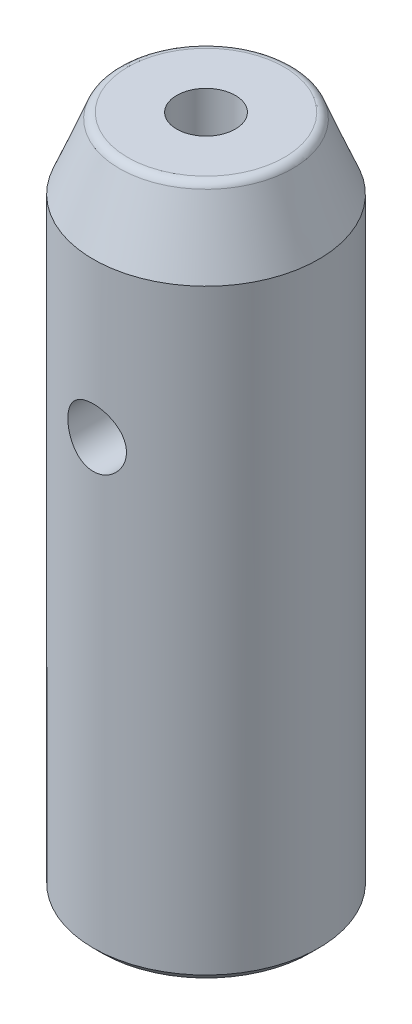
ISO-10303-21;
HEADER;
FILE_DESCRIPTION(('STEP AP214'),'2;1');
FILE_NAME('part.step','',(''),(''),'','','');
FILE_SCHEMA(('AUTOMOTIVE_DESIGN { 1 0 10303 214 1 1 1 1 }'));
ENDSEC;
DATA;
#1=APPLICATION_CONTEXT('core data for automotive mechanical design processes');
#2=APPLICATION_PROTOCOL_DEFINITION('international standard','automotive_design',2000,#1);
#3=PRODUCT_CONTEXT('',#1,'mechanical');
#4=PRODUCT('Part','Part','',(#3));
#5=PRODUCT_RELATED_PRODUCT_CATEGORY('part','',(#4));
#6=PRODUCT_DEFINITION_FORMATION('','',#4);
#7=PRODUCT_DEFINITION_CONTEXT('part definition',#1,'design');
#8=PRODUCT_DEFINITION('design','',#6,#7);
#9=PRODUCT_DEFINITION_SHAPE('','',#8);
#10=(LENGTH_UNIT() NAMED_UNIT(*) SI_UNIT(.MILLI.,.METRE.));
#11=(NAMED_UNIT(*) PLANE_ANGLE_UNIT() SI_UNIT($,.RADIAN.));
#12=(NAMED_UNIT(*) SI_UNIT($,.STERADIAN.) SOLID_ANGLE_UNIT());
#13=UNCERTAINTY_MEASURE_WITH_UNIT(LENGTH_MEASURE(1.E-05),#10,'distance_accuracy_value','');
#14=(GEOMETRIC_REPRESENTATION_CONTEXT(3) GLOBAL_UNCERTAINTY_ASSIGNED_CONTEXT((#13)) GLOBAL_UNIT_ASSIGNED_CONTEXT((#10,
#11,#12)) REPRESENTATION_CONTEXT('',''));
#15=CARTESIAN_POINT('',(0.,0.,0.));
#16=DIRECTION('',(0.,0.,1.));
#17=DIRECTION('',(1.,0.,0.));
#18=AXIS2_PLACEMENT_3D('',#15,#16,#17);
#19=CARTESIAN_POINT('',(0.,11.0000000000241,0.));
#20=DIRECTION('',(0.,-1.,0.));
#21=DIRECTION('',(0.,0.,-1.));
#22=AXIS2_PLACEMENT_3D('',#19,#20,#21);
#23=CONICAL_SURFACE('',#22,2.49999999999773,1.02974425868524);
#24=CARTESIAN_POINT('',(0.,12.5021515474941,-1.13686837721616E-10));
#25=VERTEX_POINT('',#24);
#26=VERTEX_LOOP('',#25);
#27=FACE_BOUND('',#26,.T.);
#28=CARTESIAN_POINT('',(0.,11.,0.));
#29=DIRECTION('',(0.,-1.,0.));
#30=DIRECTION('',(0.,0.,-1.));
#31=AXIS2_PLACEMENT_3D('',#28,#29,#30);
#32=CIRCLE('',#31,2.5);
#33=CARTESIAN_POINT('',(0.,11.,-2.5));
#34=VERTEX_POINT('',#33);
#35=EDGE_CURVE('E33',#34,#34,#32,.T.);
#36=ORIENTED_EDGE('',*,*,#35,.T.);
#37=EDGE_LOOP('',(#36));
#38=FACE_BOUND('',#37,.T.);
#39=ADVANCED_FACE('F17',(#27,#38),#23,.F.);
#40=CARTESIAN_POINT('',(0.,38.1,0.));
#41=DIRECTION('',(0.,1.,0.));
#42=DIRECTION('',(0.,0.,1.));
#43=AXIS2_PLACEMENT_3D('',#40,#41,#42);
#44=CYLINDRICAL_SURFACE('',#43,1.65);
#45=CARTESIAN_POINT('',(0.,38.1,0.));
#46=DIRECTION('',(0.,1.,0.));
#47=DIRECTION('',(0.,0.,1.));
#48=AXIS2_PLACEMENT_3D('',#45,#46,#47);
#49=CIRCLE('',#48,1.65);
#50=CARTESIAN_POINT('',(0.,38.1,1.65));
#51=VERTEX_POINT('',#50);
#52=EDGE_CURVE('E20',#51,#51,#49,.F.);
#53=ORIENTED_EDGE('',*,*,#52,.F.);
#54=EDGE_LOOP('',(#53));
#55=FACE_BOUND('',#54,.T.);
#56=CARTESIAN_POINT('',(0.,28.00000000002,0.));
#57=DIRECTION('',(0.,1.,0.));
#58=DIRECTION('',(0.,0.,1.));
#59=AXIS2_PLACEMENT_3D('',#56,#57,#58);
#60=CIRCLE('',#59,1.64999999992688);
#61=CARTESIAN_POINT('',(0.,28.00000000002,1.64999999992688));
#62=VERTEX_POINT('',#61);
#63=EDGE_CURVE('E37',#62,#62,#60,.F.);
#64=ORIENTED_EDGE('',*,*,#63,.T.);
#65=EDGE_LOOP('',(#64));
#66=FACE_BOUND('',#65,.T.);
#67=ADVANCED_FACE('F30',(#55,#66),#44,.F.);
#68=CARTESIAN_POINT('',(0.,0.,0.));
#69=DIRECTION('',(0.,-1.,0.));
#70=DIRECTION('',(0.,0.,-1.));
#71=AXIS2_PLACEMENT_3D('',#68,#69,#70);
#72=CYLINDRICAL_SURFACE('',#71,2.5);
#73=CARTESIAN_POINT('',(0.,0.,0.));
#74=DIRECTION('',(0.,-1.,0.));
#75=DIRECTION('',(0.,0.,-1.));
#76=AXIS2_PLACEMENT_3D('',#73,#74,#75);
#77=CIRCLE('',#76,2.5);
#78=CARTESIAN_POINT('',(0.,0.,-2.5));
#79=VERTEX_POINT('',#78);
#80=EDGE_CURVE('E95',#79,#79,#77,.T.);
#81=ORIENTED_EDGE('',*,*,#80,.T.);
#82=EDGE_LOOP('',(#81));
#83=FACE_BOUND('',#82,.T.);
#84=ORIENTED_EDGE('',*,*,#35,.F.);
#85=EDGE_LOOP('',(#84));
#86=FACE_BOUND('',#85,.T.);
#87=ADVANCED_FACE('F107',(#83,#86),#72,.F.);
#88=CARTESIAN_POINT('',(0.,38.1,0.));
#89=DIRECTION('',(0.,1.,0.));
#90=DIRECTION('',(0.,0.,1.));
#91=AXIS2_PLACEMENT_3D('',#88,#89,#90);
#92=PLANE('',#91);
#93=ORIENTED_EDGE('',*,*,#52,.T.);
#94=EDGE_LOOP('',(#93));
#95=FACE_BOUND('',#94,.T.);
#96=CARTESIAN_POINT('',(0.,38.1,0.));
#97=DIRECTION('',(0.,-1.,0.));
#98=DIRECTION('',(0.,0.,1.));
#99=AXIS2_PLACEMENT_3D('',#96,#97,#98);
#100=CIRCLE('',#99,4.41148351928659);
#101=CARTESIAN_POINT('',(0.,38.1,4.41148351928659));
#102=VERTEX_POINT('',#101);
#103=EDGE_CURVE('E90',#102,#102,#100,.T.);
#104=ORIENTED_EDGE('',*,*,#103,.F.);
#105=EDGE_LOOP('',(#104));
#106=FACE_BOUND('',#105,.T.);
#107=ADVANCED_FACE('F102',(#95,#106),#92,.T.);
#108=CARTESIAN_POINT('',(0.,28.00000000002,0.));
#109=DIRECTION('',(0.,1.,0.));
#110=DIRECTION('',(0.,0.,1.));
#111=AXIS2_PLACEMENT_3D('',#108,#109,#110);
#112=CONICAL_SURFACE('',#111,1.64999999992688,1.02974425867647);
#113=ORIENTED_EDGE('',*,*,#63,.F.);
#114=EDGE_LOOP('',(#113));
#115=FACE_BOUND('',#114,.T.);
#116=CARTESIAN_POINT('',(-0.0573261511325367,27.0490038545713,-0.0352116028123036));
#117=CARTESIAN_POINT('',(-0.0554022883564741,27.0490707375837,-0.038556116347012));
#118=CARTESIAN_POINT('',(-0.0531981532068544,27.0491440256652,-0.0417422648497794));
#119=CARTESIAN_POINT('',(-0.0482828474681584,27.049295242614,-0.0477003559953677));
#120=CARTESIAN_POINT('',(-0.045571176627391,27.0493731760078,-0.0504718850777985));
#121=CARTESIAN_POINT('',(-0.0397197199366535,27.0495244373037,-0.055503559686898));
#122=CARTESIAN_POINT('',(-0.0365810372526559,27.0495977763842,-0.0577649842878492));
#123=CARTESIAN_POINT('',(-0.0299586933464662,27.0497313166699,-0.0617075438590925));
#124=CARTESIAN_POINT('',(-0.0264751554199033,27.0497915225461,-0.0633888852683623));
#125=CARTESIAN_POINT('',(-0.0193829444498653,27.0498898330941,-0.0660675180039986));
#126=CARTESIAN_POINT('',(-0.0157819806981253,27.0499285905414,-0.0670852043273657));
#127=CARTESIAN_POINT('',(-0.00845849365793215,27.049982377865,-0.068485518452514));
#128=CARTESIAN_POINT('',(-0.00473598766995236,27.0499974111035,-0.06886823623814));
#129=CARTESIAN_POINT('',(0.0026303440330709,27.0500019182519,-0.0689835781464191));
#130=CARTESIAN_POINT('',(0.00627394045402025,27.0499919902664,-0.0687314146766817));
#131=CARTESIAN_POINT('',(0.0134664056922076,27.0499489665894,-0.0676177318403033));
#132=CARTESIAN_POINT('',(0.017015278206424,27.0499158718034,-0.066756236291472));
#133=CARTESIAN_POINT('',(0.023911489152531,27.0498303305146,-0.0644556751678007));
#134=CARTESIAN_POINT('',(0.0272592414135678,27.0497779254504,-0.0630178457912274));
#135=CARTESIAN_POINT('',(0.0336722325297795,27.0496595047019,-0.0596113616398685));
#136=CARTESIAN_POINT('',(0.0367374494462456,27.049593487962,-0.0576426656901093));
#137=CARTESIAN_POINT('',(0.042565565757976,27.0494535010409,-0.0531908473222734));
#138=CARTESIAN_POINT('',(0.0453212203986708,27.049379398544,-0.0506982522580331));
#139=CARTESIAN_POINT('',(0.0503905840951958,27.0492323170862,-0.0452983868932353));
#140=CARTESIAN_POINT('',(0.0527042278041586,27.0491593382928,-0.0423910553888745));
#141=CARTESIAN_POINT('',(0.0569012103048406,27.0490199553581,-0.0361466324304289));
#142=CARTESIAN_POINT('',(0.0587687275349002,27.0489538301738,-0.0327989006571047));
#143=CARTESIAN_POINT('',(0.0619336223044264,27.0488379981192,-0.0258437793221414));
#144=CARTESIAN_POINT('',(0.063230912492797,27.0487882937646,-0.0222363500767833));
#145=CARTESIAN_POINT('',(0.0652553482045757,27.0487094366802,-0.0147526756738244));
#146=CARTESIAN_POINT('',(0.065964975982419,27.0486809178465,-0.0108716787283606));
#147=CARTESIAN_POINT('',(0.0667340439080673,27.0486499679053,-0.00304555578656798));
#148=CARTESIAN_POINT('',(0.0667934141245729,27.0486475396036,0.000899577061502196));
#149=CARTESIAN_POINT('',(0.0662563776812016,27.0486692108696,0.00880601717686691));
#150=CARTESIAN_POINT('',(0.0656498993415126,27.0486937178691,0.0127666445127038));
#151=CARTESIAN_POINT('',(0.0637790846822597,27.0487671443867,0.0205294397628534));
#152=CARTESIAN_POINT('',(0.0625147342493535,27.0488160644286,0.0243316042757701));
#153=CARTESIAN_POINT('',(0.0593636482786148,27.0489325099751,0.0316538052088535));
#154=CARTESIAN_POINT('',(0.0574789897989906,27.0489999732662,0.0351747350834362));
#155=CARTESIAN_POINT('',(0.0531330610918169,27.0491457139671,0.0418408559754558));
#156=CARTESIAN_POINT('',(0.0506718458134014,27.0492239903461,0.0449860827564238));
#157=CARTESIAN_POINT('',(0.0452966677950328,27.0493802673108,0.0507363852188888));
#158=CARTESIAN_POINT('',(0.0423935966964446,27.0494582375328,0.0533516346682113));
#159=CARTESIAN_POINT('',(0.0361768853794523,27.0496062782607,0.0580380482193767));
#160=CARTESIAN_POINT('',(0.0328633252350365,27.0496763503024,0.0601093181899663));
#161=CARTESIAN_POINT('',(0.0260345207061876,27.0497980104142,0.0635776359221747));
#162=CARTESIAN_POINT('',(0.0225292487693694,27.0498501224462,0.0649943014809938));
#163=CARTESIAN_POINT('',(0.0153262893743198,27.0499327428713,0.0671998783707369));
#164=CARTESIAN_POINT('',(0.0116286384458393,27.0499632553499,0.0679889084196441));
#165=CARTESIAN_POINT('',(0.00425845377844512,27.0499985037144,0.0688976252329457));
#166=CARTESIAN_POINT('',(0.000588172157832474,27.0500039448395,0.0690356276513406));
#167=CARTESIAN_POINT('',(-0.00672239125698741,27.049990353846,0.0686873248544185));
#168=CARTESIAN_POINT('',(-0.0103626754763837,27.0499713237257,0.0682010706165511));
#169=CARTESIAN_POINT('',(-0.0174742174567961,27.0499112663567,0.066628908678843));
#170=CARTESIAN_POINT('',(-0.0209467584654534,27.0498704511517,0.0655487784335639));
#171=CARTESIAN_POINT('',(-0.0276647235734719,27.0497714875772,0.0628288651340028));
#172=CARTESIAN_POINT('',(-0.0309101368101057,27.0497133383792,0.0611890553342166));
#173=CARTESIAN_POINT('',(-0.0371317678743533,27.0495851175659,0.0573756078298115));
#174=CARTESIAN_POINT('',(-0.040103658519587,27.0495148926611,0.0551949234456392));
#175=CARTESIAN_POINT('',(-0.0456522709851782,27.0493706646999,0.0503787183853062));
#176=CARTESIAN_POINT('',(-0.0482289392833058,27.0492966611337,0.0477431362080121));
#177=CARTESIAN_POINT('',(-0.0529952978236249,27.0491504976728,0.0420098254992985));
#178=CARTESIAN_POINT('',(-0.0551713882269241,27.0490784558962,0.0389007905155657));
#179=CARTESIAN_POINT('',(-0.0589892048356415,27.0489463103858,0.032370363933503));
#180=CARTESIAN_POINT('',(-0.0606308682977522,27.0488862080539,0.0289489357196169));
#181=CARTESIAN_POINT('',(-0.0633853476853365,27.0487826626372,0.0217771220417472));
#182=CARTESIAN_POINT('',(-0.0644802191377082,27.0487397928603,0.0180198319858661));
#183=CARTESIAN_POINT('',(-0.0660384140146463,27.0486781191435,0.0103751798054958));
#184=CARTESIAN_POINT('',(-0.0665015009678746,27.0486593242146,0.0064877695356133));
#185=CARTESIAN_POINT('',(-0.0667883152752586,27.0486477323133,-0.00139174106050955));
#186=CARTESIAN_POINT('',(-0.0665985085714728,27.0486554856541,-0.00538433404697239));
#187=CARTESIAN_POINT('',(-0.0655536171695187,27.0486973640991,-0.0132782215478515));
#188=CARTESIAN_POINT('',(-0.0646992929569139,27.0487314590573,-0.0171796151786816));
#189=CARTESIAN_POINT('',(-0.0627577278483956,27.0488062439402,-0.0234565006415779));
#190=CARTESIAN_POINT('',(-0.0618549121945808,27.0488405131464,-0.0258906639057135));
#191=CARTESIAN_POINT('',(-0.0597856555422953,27.0489168418295,-0.0306442674073107));
#192=CARTESIAN_POINT('',(-0.0586192082689324,27.0489589014917,-0.0329637049124973));
#193=CARTESIAN_POINT('',(-0.0573261511325367,27.0490038545713,-0.0352116028123036));
#194=B_SPLINE_CURVE_WITH_KNOTS('',3,(#116,#117,#118,#119,#120,#121,#122,#123,#124,#125,#126,
#127,#128,#129,#130,#131,#132,#133,#134,#135,#136,#137,#138,#139,#140,#141,#142,#143,#144,#145,
#146,#147,#148,#149,#150,#151,#152,#153,#154,#155,#156,#157,#158,#159,#160,#161,#162,#163,#164,
#165,#166,#167,#168,#169,#170,#171,#172,#173,#174,#175,#176,#177,#178,#179,#180,#181,#182,#183,
#184,#185,#186,#187,#188,#189,#190,#191,#192,#193),.UNSPECIFIED.,.T.,.F.,(4,2,2,2,2,2,2,2,2,2,2,
2,2,2,2,2,2,2,2,2,2,2,2,2,2,2,2,2,2,2,2,2,2,2,2,2,2,2,4),(0.,0.0115675319698419,
0.0231465260800058,0.0346961551600966,0.0462416697286678,0.057413174282501,0.0685830955439932,
0.079487933392747,0.090392345012503,0.101273491483959,0.112155482159726,0.12325440338767,
0.134354964211771,0.145804638468706,0.157256066050655,0.169037677487108,0.180820555952747,
0.192784149582647,0.204747999878329,0.216672190819152,0.22859524577895,0.240261530903162,
0.251925543861198,0.263212779952904,0.274497880542819,0.285463519471979,0.296428262992586,
0.307288177678272,0.318148611401269,0.329158744395207,0.340170367101411,0.351505639797535,
0.362842242808747,0.37452978719499,0.386221704926459,0.398157436347895,0.410079528368755,
0.417854055693193,0.425628768084428),.UNSPECIFIED.);
#195=CARTESIAN_POINT('',(-0.0573261511325367,27.0490038545713,-0.0352116028123036));
#196=VERTEX_POINT('',#195);
#197=EDGE_CURVE('E86',#196,#196,#194,.T.);
#198=ORIENTED_EDGE('',*,*,#197,.T.);
#199=EDGE_LOOP('',(#198));
#200=FACE_BOUND('',#199,.T.);
#201=ADVANCED_FACE('F96',(#115,#200),#112,.F.);
#202=CARTESIAN_POINT('',(0.,0.,0.));
#203=DIRECTION('',(0.,1.,0.));
#204=DIRECTION('',(0.,0.,1.));
#205=AXIS2_PLACEMENT_3D('',#202,#203,#204);
#206=PLANE('',#205);
#207=ORIENTED_EDGE('',*,*,#80,.F.);
#208=EDGE_LOOP('',(#207));
#209=FACE_BOUND('',#208,.T.);
#210=CARTESIAN_POINT('',(0.,-1.13686837721616E-10,0.));
#211=DIRECTION('',(0.,1.,0.));
#212=DIRECTION('',(0.,0.,1.));
#213=AXIS2_PLACEMENT_3D('',#210,#211,#212);
#214=CIRCLE('',#213,5.84999999995262);
#215=CARTESIAN_POINT('',(0.,-1.13686837721616E-10,5.84999999995262));
#216=VERTEX_POINT('',#215);
#217=EDGE_CURVE('E83',#216,#216,#214,.T.);
#218=ORIENTED_EDGE('',*,*,#217,.F.);
#219=EDGE_LOOP('',(#218));
#220=FACE_BOUND('',#219,.T.);
#221=ADVANCED_FACE('F101',(#209,#220),#206,.F.);
#222=CARTESIAN_POINT('',(0.,37.6,0.));
#223=DIRECTION('',(0.,1.,0.));
#224=DIRECTION('',(0.,0.,1.));
#225=AXIS2_PLACEMENT_3D('',#222,#223,#224);
#226=TOROIDAL_SURFACE('',#225,4.41148351928659,0.5);
#227=ORIENTED_EDGE('',*,*,#103,.T.);
#228=EDGE_LOOP('',(#227));
#229=FACE_BOUND('',#228,.T.);
#230=CARTESIAN_POINT('',(0.,37.7856953381297,0.));
#231=DIRECTION('',(0.,-1.,0.));
#232=DIRECTION('',(0.,0.,-1.));
#233=AXIS2_PLACEMENT_3D('',#230,#231,#232);
#234=CIRCLE('',#233,4.87572186472107);
#235=CARTESIAN_POINT('',(0.,37.7856953381297,-4.87572186472107));
#236=VERTEX_POINT('',#235);
#237=EDGE_CURVE('E85',#236,#236,#234,.T.);
#238=ORIENTED_EDGE('',*,*,#237,.F.);
#239=EDGE_LOOP('',(#238));
#240=FACE_BOUND('',#239,.T.);
#241=ADVANCED_FACE('F76',(#229,#240),#226,.T.);
#242=CARTESIAN_POINT('',(0.,25.4,-6.35));
#243=DIRECTION('',(0.,0.,1.));
#244=DIRECTION('',(1.,0.,0.));
#245=AXIS2_PLACEMENT_3D('',#242,#243,#244);
#246=CYLINDRICAL_SURFACE('',#245,1.65);
#247=CARTESIAN_POINT('',(0.,27.05,-6.35));
#248=CARTESIAN_POINT('',(-0.091044846800309,27.0499976682171,-6.34999855029433));
#249=CARTESIAN_POINT('',(-0.182115106595808,27.0424390947502,-6.34802256023355));
#250=CARTESIAN_POINT('',(-0.361637722456892,27.012454585361,-6.34033166229604));
#251=CARTESIAN_POINT('',(-0.450088700922075,26.990020966117,-6.33461482219966));
#252=CARTESIAN_POINT('',(-0.621755015806406,26.9310607468939,-6.32007407349406));
#253=CARTESIAN_POINT('',(-0.704976759571182,26.8945518010085,-6.3112540582741));
#254=CARTESIAN_POINT('',(-0.864115385464066,26.8085413495376,-6.29144207556038));
#255=CARTESIAN_POINT('',(-0.940031879382966,26.7590391539967,-6.28044999273518));
#256=CARTESIAN_POINT('',(-1.08408361281692,26.6472915375345,-6.25721162305243));
#257=CARTESIAN_POINT('',(-1.1520343076235,26.5848124948755,-6.2449447581951));
#258=CARTESIAN_POINT('',(-1.27662045234933,26.4493844653781,-6.22067339979481));
#259=CARTESIAN_POINT('',(-1.33325452218134,26.3764342034133,-6.20866893841133));
#260=CARTESIAN_POINT('',(-1.43448627284162,26.2206782133016,-6.18607236088646));
#261=CARTESIAN_POINT('',(-1.47887409675302,26.1377319693092,-6.17550627575628));
#262=CARTESIAN_POINT('',(-1.55300255144221,25.9652354099852,-6.15728432495073));
#263=CARTESIAN_POINT('',(-1.58274573213215,25.8756862474721,-6.14962795269175));
#264=CARTESIAN_POINT('',(-1.62610440704154,25.6945636518915,-6.13830437157209));
#265=CARTESIAN_POINT('',(-1.6400533472151,25.6030753126707,-6.13455482406808));
#266=CARTESIAN_POINT('',(-1.65246676688997,25.4189861637562,-6.13122323298144));
#267=CARTESIAN_POINT('',(-1.65093398237216,25.3263855535157,-6.13164045303392));
#268=CARTESIAN_POINT('',(-1.63269273382032,25.1452833269616,-6.13652142945007));
#269=CARTESIAN_POINT('',(-1.61638516940253,25.0567379946043,-6.14087828157327));
#270=CARTESIAN_POINT('',(-1.56969829391199,24.8836852693902,-6.15297677618062));
#271=CARTESIAN_POINT('',(-1.53931790895914,24.7991781852302,-6.16071867697127));
#272=CARTESIAN_POINT('',(-1.46501490019537,24.635543333071,-6.17881066459292));
#273=CARTESIAN_POINT('',(-1.42094967522963,24.5564834562838,-6.18918799570478));
#274=CARTESIAN_POINT('',(-1.32062741969186,24.4067381047646,-6.2113666302963));
#275=CARTESIAN_POINT('',(-1.26436809941903,24.3360542066612,-6.22316820102254));
#276=CARTESIAN_POINT('',(-1.13919365005044,24.2027738510108,-6.2473127089509));
#277=CARTESIAN_POINT('',(-1.06994116814558,24.140494792232,-6.2596611060113));
#278=CARTESIAN_POINT('',(-0.921825284419546,24.0283711559869,-6.28318013507778));
#279=CARTESIAN_POINT('',(-0.842961540881459,23.9785270208217,-6.294350725182));
#280=CARTESIAN_POINT('',(-0.6773863951998,23.8925581170818,-6.31431860148111));
#281=CARTESIAN_POINT('',(-0.590645218331437,23.8564883312651,-6.32310633647018));
#282=CARTESIAN_POINT('',(-0.412050348558332,23.7995330425478,-6.33724917222535));
#283=CARTESIAN_POINT('',(-0.320197718854888,23.7786443945289,-6.34260498396524));
#284=CARTESIAN_POINT('',(-0.136698103214806,23.7531370047135,-6.34917395795849));
#285=CARTESIAN_POINT('',(-0.0451149873460234,23.7480864450094,-6.35049704173526));
#286=CARTESIAN_POINT('',(0.137588879967506,23.753209479221,-6.34916628370758));
#287=CARTESIAN_POINT('',(0.22870967574083,23.7633815847658,-6.34651283070241));
#288=CARTESIAN_POINT('',(0.406378044073726,23.7983062498575,-6.33759791632768));
#289=CARTESIAN_POINT('',(0.492975765461394,23.8228201538139,-6.33139554722162));
#290=CARTESIAN_POINT('',(0.660823076794125,23.885457311397,-6.31608436911728));
#291=CARTESIAN_POINT('',(0.742072101711473,23.9235820001213,-6.30697525364743));
#292=CARTESIAN_POINT('',(0.898610320905376,24.0131743773295,-6.28660102926498));
#293=CARTESIAN_POINT('',(0.973758422974707,24.0648798761606,-6.27529854070212));
#294=CARTESIAN_POINT('',(1.11446374988074,24.1798651154499,-6.25184511462951));
#295=CARTESIAN_POINT('',(1.18001917564773,24.2431470220242,-6.23969401859633));
#296=CARTESIAN_POINT('',(1.30148131934472,24.3814998899548,-6.21551205555071));
#297=CARTESIAN_POINT('',(1.35708406366279,24.4568402624702,-6.20349303878838));
#298=CARTESIAN_POINT('',(1.45486120763641,24.6160338615831,-6.18129455708219));
#299=CARTESIAN_POINT('',(1.49703618671815,24.6998867206493,-6.17111501277082));
#300=CARTESIAN_POINT('',(1.56644342790352,24.8732909662336,-6.1538633886004));
#301=CARTESIAN_POINT('',(1.59376344846782,24.9628053190823,-6.14677310890371));
#302=CARTESIAN_POINT('',(1.63290364352222,25.1453713800005,-6.13649272367049));
#303=CARTESIAN_POINT('',(1.64472753735072,25.2384222337294,-6.13330168226177));
#304=CARTESIAN_POINT('',(1.65233394666402,25.4223158530834,-6.13125643136561));
#305=CARTESIAN_POINT('',(1.64860385935213,25.5131373030377,-6.13227044727086));
#306=CARTESIAN_POINT('',(1.62633248920675,25.6928083988953,-6.13821413746059));
#307=CARTESIAN_POINT('',(1.60779155168882,25.7816580907206,-6.14314372045345));
#308=CARTESIAN_POINT('',(1.55670066869661,25.9542849336611,-6.15628671879343));
#309=CARTESIAN_POINT('',(1.52424906376862,26.0380930694244,-6.16447705404005));
#310=CARTESIAN_POINT('',(1.44633487299294,26.1991372793875,-6.18322034588069));
#311=CARTESIAN_POINT('',(1.40087034238607,26.2763723690169,-6.1937736555658));
#312=CARTESIAN_POINT('',(1.2967225755824,26.4244165987663,-6.2164235298058));
#313=CARTESIAN_POINT('',(1.23770439442365,26.4949847909385,-6.22855507321492));
#314=CARTESIAN_POINT('',(1.10876820201017,26.6253743094952,-6.25279366601997));
#315=CARTESIAN_POINT('',(1.03884757177488,26.6851930461999,-6.26490070882064));
#316=CARTESIAN_POINT('',(0.888403621483172,26.7935578156404,-6.28801547883296));
#317=CARTESIAN_POINT('',(0.807696217223408,26.8418544691497,-6.29899637718776));
#318=CARTESIAN_POINT('',(0.639026945353666,26.9241179017624,-6.31833266373967));
#319=CARTESIAN_POINT('',(0.551070009182763,26.9580943274653,-6.32668981840985));
#320=CARTESIAN_POINT('',(0.386139089142769,27.0060647536217,-6.33869137211507));
#321=CARTESIAN_POINT('',(0.309908192256338,27.0225033267601,-6.3429019511159));
#322=CARTESIAN_POINT('',(0.155790967896649,27.0444714653745,-6.34855676301915));
#323=CARTESIAN_POINT('',(0.0779047873851507,27.050001995248,-6.35000124047671));
#324=CARTESIAN_POINT('',(0.,27.05,-6.35));
#325=B_SPLINE_CURVE_WITH_KNOTS('',3,(#247,#248,#249,#250,#251,#252,#253,#254,#255,#256,#257,
#258,#259,#260,#261,#262,#263,#264,#265,#266,#267,#268,#269,#270,#271,#272,#273,#274,#275,#276,
#277,#278,#279,#280,#281,#282,#283,#284,#285,#286,#287,#288,#289,#290,#291,#292,#293,#294,#295,
#296,#297,#298,#299,#300,#301,#302,#303,#304,#305,#306,#307,#308,#309,#310,#311,#312,#313,#314,
#315,#316,#317,#318,#319,#320,#321,#322,#323,#324),.UNSPECIFIED.,.T.,.F.,(4,2,2,2,2,2,2,2,2,2,2,
2,2,2,2,2,2,2,2,2,2,2,2,2,2,2,2,2,2,2,2,2,2,2,2,2,2,2,4),(0.,0.27284892936646,0.545838901719088,
0.818487582289908,1.09115074372664,1.36923066335056,1.64734447476102,1.92996381752702,
2.2125339334486,2.48902023778601,2.76545768141704,3.03461179177955,3.30378644435438,
3.57586585501714,3.847996398704,4.12853593267049,4.40908544379589,4.69074339517815,
4.97234297805997,5.24619498691975,5.52002022210175,5.7894134798494,6.05883515035253,
6.33333182956842,6.60787992378509,6.88975050237247,7.17160891621467,7.45178358912652,
7.73189100294894,8.00328805481913,8.27467877924092,8.54418177129594,8.81372506115524,
9.0908273191215,9.36799624528851,9.65070850236324,9.93323000913879,10.1667206253154,
10.4001905972863),.UNSPECIFIED.);
#326=CARTESIAN_POINT('',(0.,27.05,-6.35));
#327=VERTEX_POINT('',#326);
#328=EDGE_CURVE('E53',#327,#327,#325,.T.);
#329=ORIENTED_EDGE('',*,*,#328,.F.);
#330=EDGE_LOOP('',(#329));
#331=FACE_BOUND('',#330,.T.);
#332=CARTESIAN_POINT('',(1.65,25.4,6.13188388670236));
#333=CARTESIAN_POINT('',(1.64999763632435,25.3090136721729,6.13188553974096));
#334=CARTESIAN_POINT('',(1.64244844153519,25.2180018674392,6.1339311300214));
#335=CARTESIAN_POINT('',(1.61250455514409,25.0386004900151,6.14186949481345));
#336=CARTESIAN_POINT('',(1.5901019220464,24.9502123465098,6.14776432732408));
#337=CARTESIAN_POINT('',(1.53123224488278,24.7786793338544,6.16268948392982));
#338=CARTESIAN_POINT('',(1.49478429898853,24.6955275224345,6.17171554866363));
#339=CARTESIAN_POINT('',(1.40891777621458,24.5365074719336,6.19188078325927));
#340=CARTESIAN_POINT('',(1.35949838016073,24.460639693268,6.20302008656419));
#341=CARTESIAN_POINT('',(1.24783688885235,24.31653888418,6.22645310825879));
#342=CARTESIAN_POINT('',(1.18534252309152,24.2485044869894,6.23876646120304));
#343=CARTESIAN_POINT('',(1.04984797263573,24.1237551133751,6.26299035325661));
#344=CARTESIAN_POINT('',(0.976846745509034,24.0670412614466,6.27490085225206));
#345=CARTESIAN_POINT('',(0.82104025631928,23.9657210900175,6.29719537033068));
#346=CARTESIAN_POINT('',(0.73810318933884,23.9213112699395,6.30755352225317));
#347=CARTESIAN_POINT('',(0.565626227797408,23.8471396857437,6.3253515123212));
#348=CARTESIAN_POINT('',(0.476087390988521,23.8173755808916,6.33279181676967));
#349=CARTESIAN_POINT('',(0.29502084809969,23.7739804221676,6.34377696958343));
#350=CARTESIAN_POINT('',(0.203579090054252,23.7600117165979,6.34740322613677));
#351=CARTESIAN_POINT('',(0.0195829629697857,23.7475425816485,6.35063594138407));
#352=CARTESIAN_POINT('',(-0.0729712265599142,23.7490396892051,6.35024304016357));
#353=CARTESIAN_POINT('',(-0.25421825018417,23.7672197932799,6.34554175382561));
#354=CARTESIAN_POINT('',(-0.342950470718935,23.7835381302079,6.34132739539431));
#355=CARTESIAN_POINT('',(-0.51637116985286,23.8303095949893,6.32956706077998));
#356=CARTESIAN_POINT('',(-0.601059423668877,23.8607635075599,6.32202089963765));
#357=CARTESIAN_POINT('',(-0.764931511252376,23.9352275832225,6.30430356599421));
#358=CARTESIAN_POINT('',(-0.844054909309002,23.9793646946024,6.29410796246699));
#359=CARTESIAN_POINT('',(-0.993897831944071,24.079845323999,6.27219339176723));
#360=CARTESIAN_POINT('',(-1.06461578708591,24.1361911160533,6.26047414095694));
#361=CARTESIAN_POINT('',(-1.1978163351087,24.2614334490825,6.23638166643451));
#362=CARTESIAN_POINT('',(-1.25999831770285,24.330648309973,6.22399933862566));
#363=CARTESIAN_POINT('',(-1.37194316665816,24.4786523096785,6.20028671836818));
#364=CARTESIAN_POINT('',(-1.42170535261385,24.5574419726875,6.18895648357869));
#365=CARTESIAN_POINT('',(-1.50761156967559,24.722984859806,6.16859596556769));
#366=CARTESIAN_POINT('',(-1.54367780672266,24.8097801949515,6.15957891257177));
#367=CARTESIAN_POINT('',(-1.60061006098445,24.9884943899756,6.14503216732012));
#368=CARTESIAN_POINT('',(-1.62147963009722,25.08041204721,6.139501660199));
#369=CARTESIAN_POINT('',(-1.64691605317234,25.2639600951148,6.13272673240101));
#370=CARTESIAN_POINT('',(-1.65192968322157,25.3555243073088,6.13136488687884));
#371=CARTESIAN_POINT('',(-1.6467396114869,25.5381820664328,6.13276088410879));
#372=CARTESIAN_POINT('',(-1.63653743698053,25.62927565968,6.13551831339115));
#373=CARTESIAN_POINT('',(-1.60159835751182,25.8067111032332,6.14472911696835));
#374=CARTESIAN_POINT('',(-1.57712648589762,25.8931089807301,6.15111504469164));
#375=CARTESIAN_POINT('',(-1.51463894373683,26.0605749139209,6.16679819321596));
#376=CARTESIAN_POINT('',(-1.47662157165586,26.1416422985022,6.17609577975075));
#377=CARTESIAN_POINT('',(-1.38720350487008,26.2980251849691,6.19679824352577));
#378=CARTESIAN_POINT('',(-1.33553846790759,26.3731841014284,6.20824328210405));
#379=CARTESIAN_POINT('',(-1.22062204687912,26.5139295571017,6.23185492577481));
#380=CARTESIAN_POINT('',(-1.15736859903678,26.5795143875257,6.24402165913229));
#381=CARTESIAN_POINT('',(-1.0190110408921,26.7010858779193,6.26810744462941));
#382=CARTESIAN_POINT('',(-0.943630791915351,26.7567620081884,6.28001069362144));
#383=CARTESIAN_POINT('',(-0.784333377232096,26.8546682026395,6.3018866129425));
#384=CARTESIAN_POINT('',(-0.700416664129448,26.8968989792051,6.31185938554421));
#385=CARTESIAN_POINT('',(-0.527016611327761,26.9663359250745,6.3286868090298));
#386=CARTESIAN_POINT('',(-0.437579952621997,26.9936528480859,6.33556437657373));
#387=CARTESIAN_POINT('',(-0.255181418968194,27.0328129713154,6.34552712562432));
#388=CARTESIAN_POINT('',(-0.162220287138928,27.0446594149465,6.34861310203662));
#389=CARTESIAN_POINT('',(0.0216806405939058,27.0523476975197,6.35060954213632));
#390=CARTESIAN_POINT('',(0.112600330589238,27.048646169765,6.34963914291606));
#391=CARTESIAN_POINT('',(0.292475723160711,27.026397859056,6.34389911049899));
#392=CARTESIAN_POINT('',(0.381431492826548,27.0078515840235,6.33912960729081));
#393=CARTESIAN_POINT('',(0.554334249605663,26.9566930536534,6.32634877587924));
#394=CARTESIAN_POINT('',(0.638309022049673,26.9241692711005,6.31835785750941));
#395=CARTESIAN_POINT('',(0.799657538098567,26.8460583586729,6.29997214989296));
#396=CARTESIAN_POINT('',(0.877030391538031,26.800469470774,6.2895770371773));
#397=CARTESIAN_POINT('',(1.02512119470899,26.6961626073455,6.26716709585033));
#398=CARTESIAN_POINT('',(1.09561856239326,26.6371389033826,6.25511766534272));
#399=CARTESIAN_POINT('',(1.22586275551583,26.5082234335704,6.23090349817101));
#400=CARTESIAN_POINT('',(1.28560679239572,26.4383288574161,6.21873873245658));
#401=CARTESIAN_POINT('',(1.39386165712694,26.2879245968643,6.19538429010402));
#402=CARTESIAN_POINT('',(1.44211599306216,26.2072260515196,6.18421983395787));
#403=CARTESIAN_POINT('',(1.52430254643322,26.0385820488824,6.16447892641519));
#404=CARTESIAN_POINT('',(1.55824457593226,25.9506416060051,6.15590070313312));
#405=CARTESIAN_POINT('',(1.60614388011357,25.7857937772314,6.14355741275247));
#406=CARTESIAN_POINT('',(1.62255248361923,25.7096329869087,6.13921421063347));
#407=CARTESIAN_POINT('',(1.64448100300523,25.5556542335596,6.13337688486827));
#408=CARTESIAN_POINT('',(1.6500020220631,25.4778364392358,6.13188247257078));
#409=CARTESIAN_POINT('',(1.65,25.4,6.13188388670236));
#410=B_SPLINE_CURVE_WITH_KNOTS('',3,(#332,#333,#334,#335,#336,#337,#338,#339,#340,#341,#342,
#343,#344,#345,#346,#347,#348,#349,#350,#351,#352,#353,#354,#355,#356,#357,#358,#359,#360,#361,
#362,#363,#364,#365,#366,#367,#368,#369,#370,#371,#372,#373,#374,#375,#376,#377,#378,#379,#380,
#381,#382,#383,#384,#385,#386,#387,#388,#389,#390,#391,#392,#393,#394,#395,#396,#397,#398,#399,
#400,#401,#402,#403,#404,#405,#406,#407,#408,#409),.UNSPECIFIED.,.T.,.F.,(4,2,2,2,2,2,2,2,2,2,2,
2,2,2,2,2,2,2,2,2,2,2,2,2,2,2,2,2,2,2,2,2,2,2,2,2,2,2,4),(0.,0.272672926683559,
0.545491757562704,0.817940923503117,1.09040729931829,1.36871710122714,1.64705453452928,
1.92960985094953,2.21211999361816,2.48846958169583,2.76477515940422,3.03446142923302,
3.30416267211513,3.5764450408944,3.84877816974043,4.12905991840253,4.40935701863626,
4.69122322600105,4.97302353196758,5.24680930902986,5.52056760685325,5.78939636875262,
6.05825891181399,6.33276889460925,6.60732781240532,6.88937426953431,7.1714057803291,
7.45131334025021,7.73116220763911,8.00285046042544,8.27452941763362,8.54451349870581,
8.81453392556819,9.09145439408537,9.36844657060045,9.65113942210742,9.93363815202069,
10.1669263945671,10.400190998117),.UNSPECIFIED.);
#411=CARTESIAN_POINT('',(1.65,25.4,6.13188388670236));
#412=VERTEX_POINT('',#411);
#413=EDGE_CURVE('E46',#412,#412,#410,.T.);
#414=ORIENTED_EDGE('',*,*,#413,.F.);
#415=EDGE_LOOP('',(#414));
#416=FACE_BOUND('',#415,.T.);
#417=ORIENTED_EDGE('',*,*,#197,.F.);
#418=EDGE_LOOP('',(#417));
#419=FACE_BOUND('',#418,.T.);
#420=ADVANCED_FACE('F57',(#331,#416,#419),#246,.F.);
#421=CARTESIAN_POINT('',(0.,0.499999999931333,0.));
#422=DIRECTION('',(0.,1.,0.));
#423=DIRECTION('',(0.,0.,1.));
#424=AXIS2_PLACEMENT_3D('',#421,#422,#423);
#425=CONICAL_SURFACE('',#424,6.34999999999764,0.785398163397448);
#426=CARTESIAN_POINT('',(0.,0.500000000000028,0.));
#427=DIRECTION('',(0.,-1.,0.));
#428=DIRECTION('',(0.,0.,-1.));
#429=AXIS2_PLACEMENT_3D('',#426,#427,#428);
#430=CIRCLE('',#429,6.35);
#431=CARTESIAN_POINT('',(0.,0.500000000000028,-6.35));
#432=VERTEX_POINT('',#431);
#433=EDGE_CURVE('E24',#432,#432,#430,.F.);
#434=ORIENTED_EDGE('',*,*,#433,.F.);
#435=EDGE_LOOP('',(#434));
#436=FACE_BOUND('',#435,.T.);
#437=ORIENTED_EDGE('',*,*,#217,.T.);
#438=EDGE_LOOP('',(#437));
#439=FACE_BOUND('',#438,.T.);
#440=ADVANCED_FACE('F68',(#436,#439),#425,.T.);
#441=CARTESIAN_POINT('',(0.,34.1000000000236,0.));
#442=DIRECTION('',(0.,-1.,0.));
#443=DIRECTION('',(0.,0.,-1.));
#444=AXIS2_PLACEMENT_3D('',#441,#442,#443);
#445=CONICAL_SURFACE('',#444,6.34999999996921,0.380506377113694);
#446=CARTESIAN_POINT('',(0.,34.1000000000001,0.));
#447=DIRECTION('',(0.,-1.,0.));
#448=DIRECTION('',(0.,0.,-1.));
#449=AXIS2_PLACEMENT_3D('',#446,#447,#448);
#450=CIRCLE('',#449,6.35);
#451=CARTESIAN_POINT('',(0.,34.1000000000001,-6.35));
#452=VERTEX_POINT('',#451);
#453=EDGE_CURVE('E10',#452,#452,#450,.T.);
#454=ORIENTED_EDGE('',*,*,#453,.F.);
#455=EDGE_LOOP('',(#454));
#456=FACE_BOUND('',#455,.T.);
#457=ORIENTED_EDGE('',*,*,#237,.T.);
#458=EDGE_LOOP('',(#457));
#459=FACE_BOUND('',#458,.T.);
#460=ADVANCED_FACE('F64',(#456,#459),#445,.T.);
#461=CARTESIAN_POINT('',(0.,38.1,0.));
#462=DIRECTION('',(0.,-1.,0.));
#463=DIRECTION('',(0.,0.,-1.));
#464=AXIS2_PLACEMENT_3D('',#461,#462,#463);
#465=CYLINDRICAL_SURFACE('',#464,6.35);
#466=ORIENTED_EDGE('',*,*,#453,.T.);
#467=EDGE_LOOP('',(#466));
#468=FACE_BOUND('',#467,.T.);
#469=ORIENTED_EDGE('',*,*,#433,.T.);
#470=EDGE_LOOP('',(#469));
#471=FACE_BOUND('',#470,.T.);
#472=ORIENTED_EDGE('',*,*,#413,.T.);
#473=EDGE_LOOP('',(#472));
#474=FACE_BOUND('',#473,.T.);
#475=ORIENTED_EDGE('',*,*,#328,.T.);
#476=EDGE_LOOP('',(#475));
#477=FACE_BOUND('',#476,.T.);
#478=ADVANCED_FACE('F60',(#468,#471,#474,#477),#465,.T.);
#479=CLOSED_SHELL('',(#39,#67,#87,#107,#201,#221,#241,#420,#440,#460,#478));
#480=MANIFOLD_SOLID_BREP('B1',#479);
#481=ADVANCED_BREP_SHAPE_REPRESENTATION('',(#18,#480),#14);
#482=SHAPE_DEFINITION_REPRESENTATION(#9,#481);
ENDSEC;
END-ISO-10303-21;
